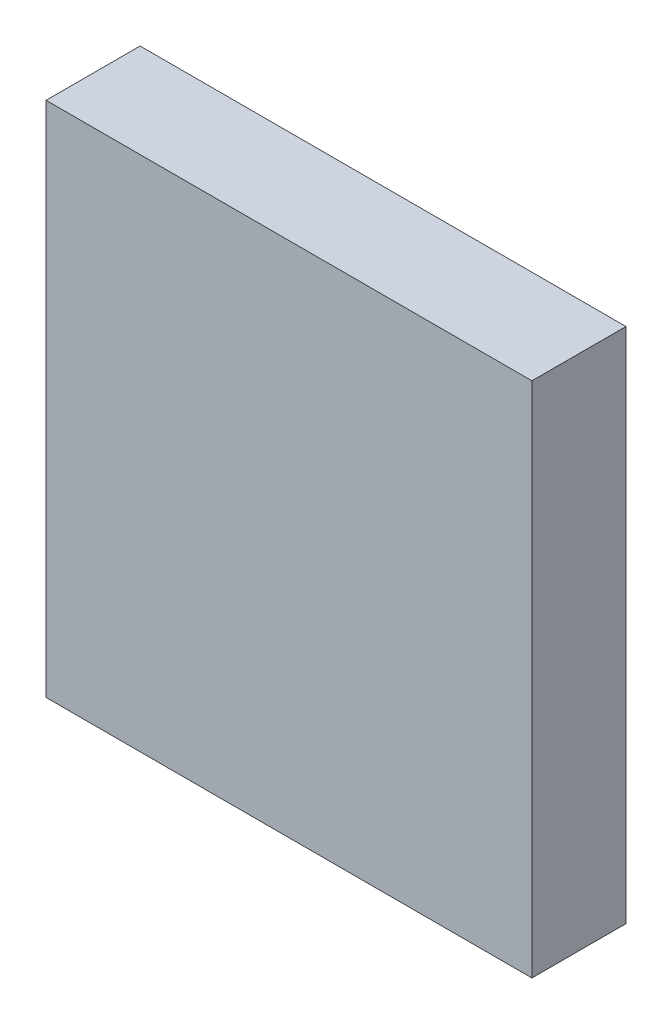
ISO-10303-21;
HEADER;
FILE_DESCRIPTION(('STEP AP214'),'2;1');
FILE_NAME('part.step','',(''),(''),'','','');
FILE_SCHEMA(('AUTOMOTIVE_DESIGN { 1 0 10303 214 1 1 1 1 }'));
ENDSEC;
DATA;
#1=APPLICATION_CONTEXT('core data for automotive mechanical design processes');
#2=APPLICATION_PROTOCOL_DEFINITION('international standard','automotive_design',2000,#1);
#3=PRODUCT_CONTEXT('',#1,'mechanical');
#4=PRODUCT('Part','Part','',(#3));
#5=PRODUCT_RELATED_PRODUCT_CATEGORY('part','',(#4));
#6=PRODUCT_DEFINITION_FORMATION('','',#4);
#7=PRODUCT_DEFINITION_CONTEXT('part definition',#1,'design');
#8=PRODUCT_DEFINITION('design','',#6,#7);
#9=PRODUCT_DEFINITION_SHAPE('','',#8);
#10=(LENGTH_UNIT() NAMED_UNIT(*) SI_UNIT(.MILLI.,.METRE.));
#11=(NAMED_UNIT(*) PLANE_ANGLE_UNIT() SI_UNIT($,.RADIAN.));
#12=(NAMED_UNIT(*) SI_UNIT($,.STERADIAN.) SOLID_ANGLE_UNIT());
#13=UNCERTAINTY_MEASURE_WITH_UNIT(LENGTH_MEASURE(1.E-05),#10,'distance_accuracy_value','');
#14=(GEOMETRIC_REPRESENTATION_CONTEXT(3) GLOBAL_UNCERTAINTY_ASSIGNED_CONTEXT((#13)) GLOBAL_UNIT_ASSIGNED_CONTEXT((#10,
#11,#12)) REPRESENTATION_CONTEXT('',''));
#15=CARTESIAN_POINT('',(0.,0.,0.));
#16=DIRECTION('',(0.,0.,1.));
#17=DIRECTION('',(1.,0.,0.));
#18=AXIS2_PLACEMENT_3D('',#15,#16,#17);
#19=CARTESIAN_POINT('',(-1.54999944,1.64999924,0.));
#20=DIRECTION('',(0.,0.,1.));
#21=DIRECTION('',(1.,0.,0.));
#22=AXIS2_PLACEMENT_3D('',#19,#20,#21);
#23=PLANE('',#22);
#24=DIRECTION('',(0.,1.,0.));
#25=VECTOR('',#24,1.);
#26=CARTESIAN_POINT('',(1.54999944,1.64999924,0.));
#27=LINE('',#26,#25);
#28=CARTESIAN_POINT('',(1.54999944,-1.64999924,0.));
#29=VERTEX_POINT('',#28);
#30=CARTESIAN_POINT('',(1.54999944,1.64999924,0.));
#31=VERTEX_POINT('',#30);
#32=EDGE_CURVE('E67',#29,#31,#27,.T.);
#33=ORIENTED_EDGE('',*,*,#32,.F.);
#34=DIRECTION('',(1.,0.,0.));
#35=VECTOR('',#34,1.);
#36=CARTESIAN_POINT('',(1.54999944,-1.64999924,0.));
#37=LINE('',#36,#35);
#38=CARTESIAN_POINT('',(-1.54999944,-1.64999924,0.));
#39=VERTEX_POINT('',#38);
#40=EDGE_CURVE('E54',#39,#29,#37,.T.);
#41=ORIENTED_EDGE('',*,*,#40,.F.);
#42=DIRECTION('',(0.,1.,0.));
#43=VECTOR('',#42,1.);
#44=CARTESIAN_POINT('',(-1.54999944,-1.64999924,0.));
#45=LINE('',#44,#43);
#46=CARTESIAN_POINT('',(-1.54999944,1.64999924,0.));
#47=VERTEX_POINT('',#46);
#48=EDGE_CURVE('E19',#47,#39,#45,.F.);
#49=ORIENTED_EDGE('',*,*,#48,.F.);
#50=DIRECTION('',(1.,0.,0.));
#51=VECTOR('',#50,1.);
#52=CARTESIAN_POINT('',(-1.54999944,1.64999924,0.));
#53=LINE('',#52,#51);
#54=EDGE_CURVE('E80',#31,#47,#53,.F.);
#55=ORIENTED_EDGE('',*,*,#54,.F.);
#56=EDGE_LOOP('',(#33,#41,#49,#55));
#57=FACE_BOUND('',#56,.T.);
#58=ADVANCED_FACE('F16',(#57),#23,.F.);
#59=CARTESIAN_POINT('',(-1.54999944,-1.64999924,0.));
#60=DIRECTION('',(-1.,0.,0.));
#61=DIRECTION('',(0.,0.,1.));
#62=AXIS2_PLACEMENT_3D('',#59,#60,#61);
#63=PLANE('',#62);
#64=DIRECTION('',(0.,0.,1.));
#65=VECTOR('',#64,1.);
#66=CARTESIAN_POINT('',(-1.54999944,1.64999924,0.));
#67=LINE('',#66,#65);
#68=CARTESIAN_POINT('',(-1.54999944,1.64999924,0.5999988));
#69=VERTEX_POINT('',#68);
#70=EDGE_CURVE('E63',#47,#69,#67,.T.);
#71=ORIENTED_EDGE('',*,*,#70,.F.);
#72=ORIENTED_EDGE('',*,*,#48,.T.);
#73=DIRECTION('',(0.,0.,-1.));
#74=VECTOR('',#73,1.);
#75=CARTESIAN_POINT('',(-1.54999944,-1.64999924,0.));
#76=LINE('',#75,#74);
#77=CARTESIAN_POINT('',(-1.54999944,-1.64999924,0.5999988));
#78=VERTEX_POINT('',#77);
#79=EDGE_CURVE('E60',#78,#39,#76,.T.);
#80=ORIENTED_EDGE('',*,*,#79,.F.);
#81=DIRECTION('',(0.,1.,0.));
#82=VECTOR('',#81,1.);
#83=CARTESIAN_POINT('',(-1.54999944,1.64999924,0.5999988));
#84=LINE('',#83,#82);
#85=EDGE_CURVE('E82',#69,#78,#84,.F.);
#86=ORIENTED_EDGE('',*,*,#85,.F.);
#87=EDGE_LOOP('',(#71,#72,#80,#86));
#88=FACE_BOUND('',#87,.T.);
#89=ADVANCED_FACE('F59',(#88),#63,.T.);
#90=CARTESIAN_POINT('',(1.54999944,-1.64999924,0.));
#91=DIRECTION('',(0.,-1.,0.));
#92=DIRECTION('',(0.,0.,-1.));
#93=AXIS2_PLACEMENT_3D('',#90,#91,#92);
#94=PLANE('',#93);
#95=ORIENTED_EDGE('',*,*,#79,.T.);
#96=ORIENTED_EDGE('',*,*,#40,.T.);
#97=DIRECTION('',(0.,0.,-1.));
#98=VECTOR('',#97,1.);
#99=CARTESIAN_POINT('',(1.54999944,-1.64999924,0.));
#100=LINE('',#99,#98);
#101=CARTESIAN_POINT('',(1.54999944,-1.64999924,0.5999988));
#102=VERTEX_POINT('',#101);
#103=EDGE_CURVE('E69',#102,#29,#100,.T.);
#104=ORIENTED_EDGE('',*,*,#103,.F.);
#105=DIRECTION('',(1.,0.,0.));
#106=VECTOR('',#105,1.);
#107=CARTESIAN_POINT('',(-1.54999944,-1.64999924,0.5999988));
#108=LINE('',#107,#106);
#109=EDGE_CURVE('E73',#78,#102,#108,.T.);
#110=ORIENTED_EDGE('',*,*,#109,.F.);
#111=EDGE_LOOP('',(#95,#96,#104,#110));
#112=FACE_BOUND('',#111,.T.);
#113=ADVANCED_FACE('F71',(#112),#94,.T.);
#114=CARTESIAN_POINT('',(1.54999944,1.64999924,0.));
#115=DIRECTION('',(1.,0.,0.));
#116=DIRECTION('',(0.,0.,-1.));
#117=AXIS2_PLACEMENT_3D('',#114,#115,#116);
#118=PLANE('',#117);
#119=ORIENTED_EDGE('',*,*,#103,.T.);
#120=ORIENTED_EDGE('',*,*,#32,.T.);
#121=DIRECTION('',(0.,0.,1.));
#122=VECTOR('',#121,1.);
#123=CARTESIAN_POINT('',(1.54999944,1.64999924,0.));
#124=LINE('',#123,#122);
#125=CARTESIAN_POINT('',(1.54999944,1.64999924,0.5999988));
#126=VERTEX_POINT('',#125);
#127=EDGE_CURVE('E34',#126,#31,#124,.F.);
#128=ORIENTED_EDGE('',*,*,#127,.F.);
#129=DIRECTION('',(0.,1.,0.));
#130=VECTOR('',#129,1.);
#131=CARTESIAN_POINT('',(1.54999944,1.64999924,0.5999988));
#132=LINE('',#131,#130);
#133=EDGE_CURVE('E25',#102,#126,#132,.T.);
#134=ORIENTED_EDGE('',*,*,#133,.F.);
#135=EDGE_LOOP('',(#119,#120,#128,#134));
#136=FACE_BOUND('',#135,.T.);
#137=ADVANCED_FACE('F88',(#136),#118,.T.);
#138=CARTESIAN_POINT('',(-1.54999944,1.64999924,0.));
#139=DIRECTION('',(0.,1.,0.));
#140=DIRECTION('',(0.,0.,1.));
#141=AXIS2_PLACEMENT_3D('',#138,#139,#140);
#142=PLANE('',#141);
#143=ORIENTED_EDGE('',*,*,#127,.T.);
#144=ORIENTED_EDGE('',*,*,#54,.T.);
#145=ORIENTED_EDGE('',*,*,#70,.T.);
#146=DIRECTION('',(1.,0.,0.));
#147=VECTOR('',#146,1.);
#148=CARTESIAN_POINT('',(-1.54999944,1.64999924,0.5999988));
#149=LINE('',#148,#147);
#150=EDGE_CURVE('E11',#126,#69,#149,.F.);
#151=ORIENTED_EDGE('',*,*,#150,.F.);
#152=EDGE_LOOP('',(#143,#144,#145,#151));
#153=FACE_BOUND('',#152,.T.);
#154=ADVANCED_FACE('F90',(#153),#142,.T.);
#155=CARTESIAN_POINT('',(-1.54999944,1.64999924,0.5999988));
#156=DIRECTION('',(0.,0.,1.));
#157=DIRECTION('',(1.,0.,0.));
#158=AXIS2_PLACEMENT_3D('',#155,#156,#157);
#159=PLANE('',#158);
#160=ORIENTED_EDGE('',*,*,#133,.T.);
#161=ORIENTED_EDGE('',*,*,#150,.T.);
#162=ORIENTED_EDGE('',*,*,#85,.T.);
#163=ORIENTED_EDGE('',*,*,#109,.T.);
#164=EDGE_LOOP('',(#160,#161,#162,#163));
#165=FACE_BOUND('',#164,.T.);
#166=ADVANCED_FACE('F87',(#165),#159,.T.);
#167=CLOSED_SHELL('',(#58,#89,#113,#137,#154,#166));
#168=MANIFOLD_SOLID_BREP('B1',#167);
#169=ADVANCED_BREP_SHAPE_REPRESENTATION('',(#18,#168),#14);
#170=SHAPE_DEFINITION_REPRESENTATION(#9,#169);
ENDSEC;
END-ISO-10303-21;
